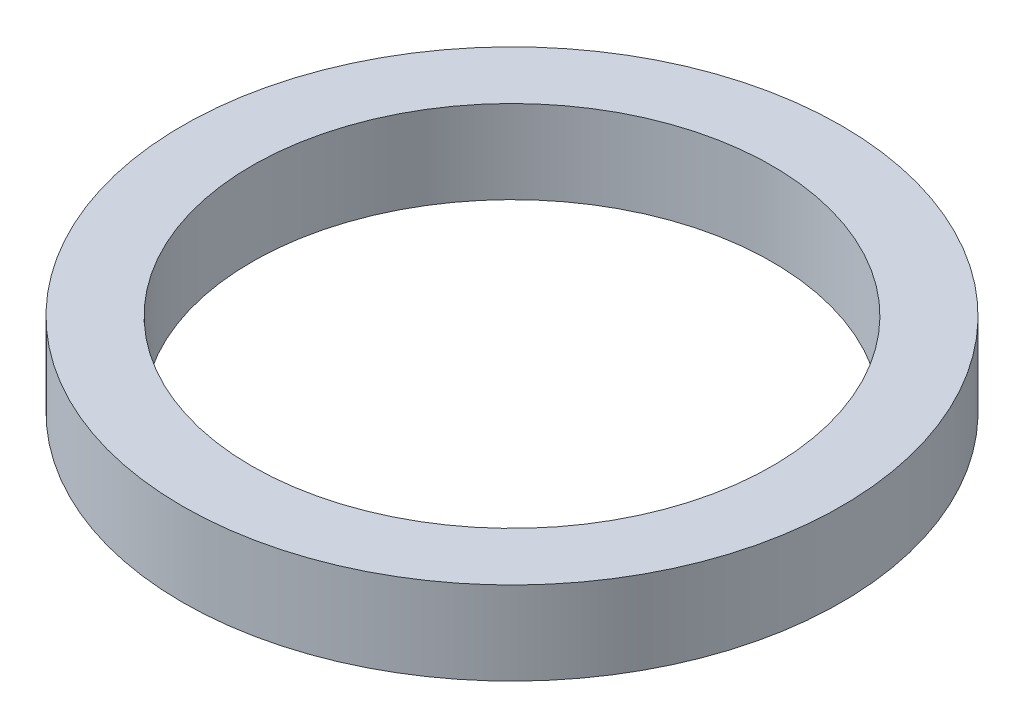
ISO-10303-21;
HEADER;
FILE_DESCRIPTION(('STEP AP214'),'2;1');
FILE_NAME('part.step','',(''),(''),'','','');
FILE_SCHEMA(('AUTOMOTIVE_DESIGN { 1 0 10303 214 1 1 1 1 }'));
ENDSEC;
DATA;
#1=APPLICATION_CONTEXT('core data for automotive mechanical design processes');
#2=APPLICATION_PROTOCOL_DEFINITION('international standard','automotive_design',2000,#1);
#3=PRODUCT_CONTEXT('',#1,'mechanical');
#4=PRODUCT('Part','Part','',(#3));
#5=PRODUCT_RELATED_PRODUCT_CATEGORY('part','',(#4));
#6=PRODUCT_DEFINITION_FORMATION('','',#4);
#7=PRODUCT_DEFINITION_CONTEXT('part definition',#1,'design');
#8=PRODUCT_DEFINITION('design','',#6,#7);
#9=PRODUCT_DEFINITION_SHAPE('','',#8);
#10=(LENGTH_UNIT() NAMED_UNIT(*) SI_UNIT(.MILLI.,.METRE.));
#11=(NAMED_UNIT(*) PLANE_ANGLE_UNIT() SI_UNIT($,.RADIAN.));
#12=(NAMED_UNIT(*) SI_UNIT($,.STERADIAN.) SOLID_ANGLE_UNIT());
#13=UNCERTAINTY_MEASURE_WITH_UNIT(LENGTH_MEASURE(1.E-05),#10,'distance_accuracy_value','');
#14=(GEOMETRIC_REPRESENTATION_CONTEXT(3) GLOBAL_UNCERTAINTY_ASSIGNED_CONTEXT((#13)) GLOBAL_UNIT_ASSIGNED_CONTEXT((#10,
#11,#12)) REPRESENTATION_CONTEXT('',''));
#15=CARTESIAN_POINT('',(0.,0.,0.));
#16=DIRECTION('',(0.,0.,1.));
#17=DIRECTION('',(1.,0.,0.));
#18=AXIS2_PLACEMENT_3D('',#15,#16,#17);
#19=CARTESIAN_POINT('',(0.,12.,0.));
#20=DIRECTION('',(0.,-1.,0.));
#21=DIRECTION('',(0.,0.,-1.));
#22=AXIS2_PLACEMENT_3D('',#19,#20,#21);
#23=CYLINDRICAL_SURFACE('',#22,47.5);
#24=CARTESIAN_POINT('',(0.,12.,0.));
#25=DIRECTION('',(0.,1.,0.));
#26=DIRECTION('',(0.,0.,1.));
#27=AXIS2_PLACEMENT_3D('',#24,#25,#26);
#28=CIRCLE('',#27,47.5);
#29=CARTESIAN_POINT('',(0.,12.,47.5));
#30=VERTEX_POINT('',#29);
#31=EDGE_CURVE('E10',#30,#30,#28,.T.);
#32=ORIENTED_EDGE('',*,*,#31,.F.);
#33=EDGE_LOOP('',(#32));
#34=FACE_BOUND('',#33,.T.);
#35=CARTESIAN_POINT('',(0.,0.,0.));
#36=DIRECTION('',(0.,1.,0.));
#37=DIRECTION('',(0.,0.,1.));
#38=AXIS2_PLACEMENT_3D('',#35,#36,#37);
#39=CIRCLE('',#38,47.5);
#40=CARTESIAN_POINT('',(0.,0.,47.5));
#41=VERTEX_POINT('',#40);
#42=EDGE_CURVE('E37',#41,#41,#39,.T.);
#43=ORIENTED_EDGE('',*,*,#42,.T.);
#44=EDGE_LOOP('',(#43));
#45=FACE_BOUND('',#44,.T.);
#46=ADVANCED_FACE('F40',(#34,#45),#23,.T.);
#47=CARTESIAN_POINT('',(0.,12.,0.));
#48=DIRECTION('',(0.,1.,0.));
#49=DIRECTION('',(0.,0.,1.));
#50=AXIS2_PLACEMENT_3D('',#47,#48,#49);
#51=PLANE('',#50);
#52=CARTESIAN_POINT('',(0.,12.,0.));
#53=DIRECTION('',(0.,1.,0.));
#54=DIRECTION('',(0.,0.,1.));
#55=AXIS2_PLACEMENT_3D('',#52,#53,#54);
#56=CIRCLE('',#55,37.5);
#57=CARTESIAN_POINT('',(0.,12.,37.5));
#58=VERTEX_POINT('',#57);
#59=EDGE_CURVE('E50',#58,#58,#56,.T.);
#60=ORIENTED_EDGE('',*,*,#59,.F.);
#61=EDGE_LOOP('',(#60));
#62=FACE_BOUND('',#61,.T.);
#63=ORIENTED_EDGE('',*,*,#31,.T.);
#64=EDGE_LOOP('',(#63));
#65=FACE_BOUND('',#64,.T.);
#66=ADVANCED_FACE('F59',(#62,#65),#51,.T.);
#67=CARTESIAN_POINT('',(0.,0.,0.));
#68=DIRECTION('',(0.,1.,0.));
#69=DIRECTION('',(0.,0.,1.));
#70=AXIS2_PLACEMENT_3D('',#67,#68,#69);
#71=PLANE('',#70);
#72=CARTESIAN_POINT('',(0.,0.,0.));
#73=DIRECTION('',(0.,1.,0.));
#74=DIRECTION('',(0.,0.,1.));
#75=AXIS2_PLACEMENT_3D('',#72,#73,#74);
#76=CIRCLE('',#75,37.5);
#77=CARTESIAN_POINT('',(0.,0.,37.5));
#78=VERTEX_POINT('',#77);
#79=EDGE_CURVE('E47',#78,#78,#76,.T.);
#80=ORIENTED_EDGE('',*,*,#79,.T.);
#81=EDGE_LOOP('',(#80));
#82=FACE_BOUND('',#81,.T.);
#83=ORIENTED_EDGE('',*,*,#42,.F.);
#84=EDGE_LOOP('',(#83));
#85=FACE_BOUND('',#84,.T.);
#86=ADVANCED_FACE('F58',(#82,#85),#71,.F.);
#87=CARTESIAN_POINT('',(0.,12.,0.));
#88=DIRECTION('',(0.,-1.,0.));
#89=DIRECTION('',(0.,0.,-1.));
#90=AXIS2_PLACEMENT_3D('',#87,#88,#89);
#91=CYLINDRICAL_SURFACE('',#90,37.5);
#92=ORIENTED_EDGE('',*,*,#59,.T.);
#93=EDGE_LOOP('',(#92));
#94=FACE_BOUND('',#93,.T.);
#95=ORIENTED_EDGE('',*,*,#79,.F.);
#96=EDGE_LOOP('',(#95));
#97=FACE_BOUND('',#96,.T.);
#98=ADVANCED_FACE('F54',(#94,#97),#91,.F.);
#99=CLOSED_SHELL('',(#46,#66,#86,#98));
#100=MANIFOLD_SOLID_BREP('B2',#99);
#101=ADVANCED_BREP_SHAPE_REPRESENTATION('',(#18,#100),#14);
#102=SHAPE_DEFINITION_REPRESENTATION(#9,#101);
ENDSEC;
END-ISO-10303-21;
